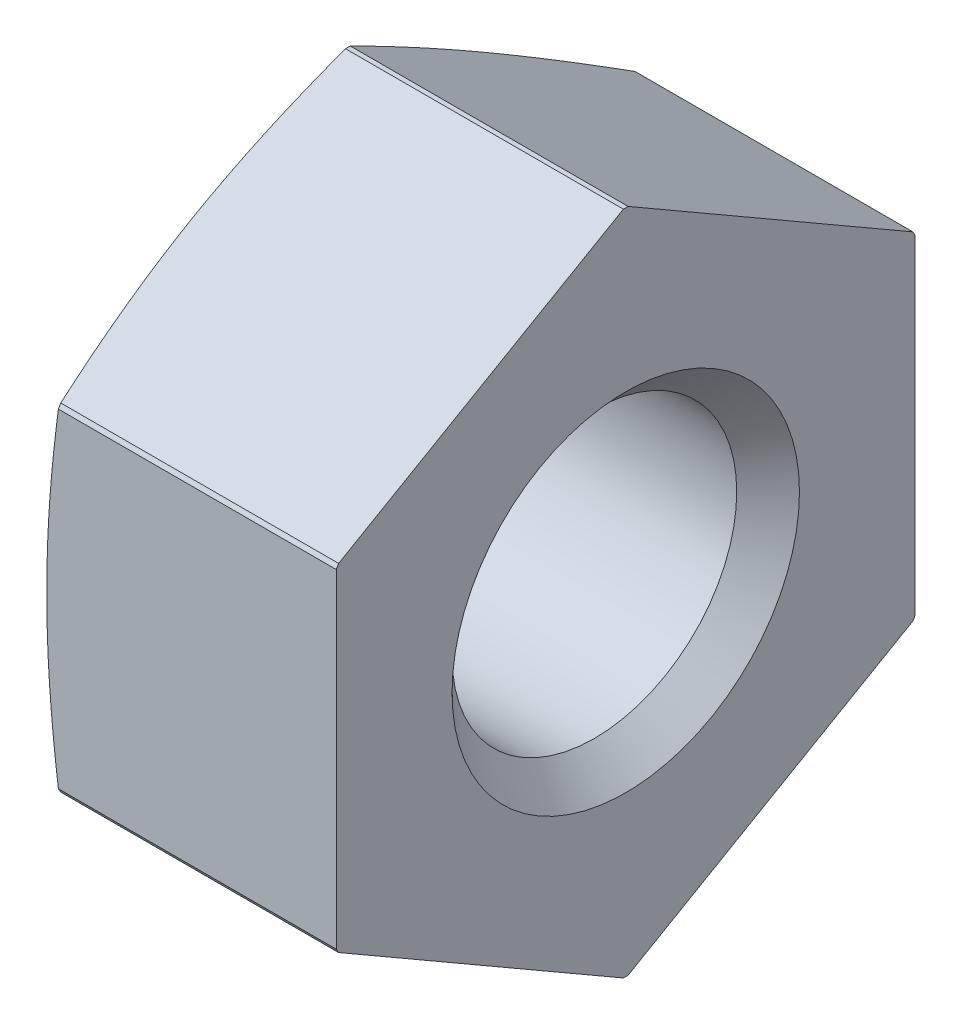
ISO-10303-21;
HEADER;
FILE_DESCRIPTION(('STEP AP214'),'2;1');
FILE_NAME('part.step','',(''),(''),'','','');
FILE_SCHEMA(('AUTOMOTIVE_DESIGN { 1 0 10303 214 1 1 1 1 }'));
ENDSEC;
DATA;
#1=APPLICATION_CONTEXT('core data for automotive mechanical design processes');
#2=APPLICATION_PROTOCOL_DEFINITION('international standard','automotive_design',2000,#1);
#3=PRODUCT_CONTEXT('',#1,'mechanical');
#4=PRODUCT('Part','Part','',(#3));
#5=PRODUCT_RELATED_PRODUCT_CATEGORY('part','',(#4));
#6=PRODUCT_DEFINITION_FORMATION('','',#4);
#7=PRODUCT_DEFINITION_CONTEXT('part definition',#1,'design');
#8=PRODUCT_DEFINITION('design','',#6,#7);
#9=PRODUCT_DEFINITION_SHAPE('','',#8);
#10=(LENGTH_UNIT() NAMED_UNIT(*) SI_UNIT(.MILLI.,.METRE.));
#11=(NAMED_UNIT(*) PLANE_ANGLE_UNIT() SI_UNIT($,.RADIAN.));
#12=(NAMED_UNIT(*) SI_UNIT($,.STERADIAN.) SOLID_ANGLE_UNIT());
#13=UNCERTAINTY_MEASURE_WITH_UNIT(LENGTH_MEASURE(1.E-05),#10,'distance_accuracy_value','');
#14=(GEOMETRIC_REPRESENTATION_CONTEXT(3) GLOBAL_UNCERTAINTY_ASSIGNED_CONTEXT((#13)) GLOBAL_UNIT_ASSIGNED_CONTEXT((#10,
#11,#12)) REPRESENTATION_CONTEXT('',''));
#15=CARTESIAN_POINT('',(0.,0.,0.));
#16=DIRECTION('',(0.,0.,1.));
#17=DIRECTION('',(1.,0.,0.));
#18=AXIS2_PLACEMENT_3D('',#15,#16,#17);
#19=CARTESIAN_POINT('',(4.4585,0.,0.));
#20=DIRECTION('',(1.,0.,0.));
#21=DIRECTION('',(0.,0.,-1.));
#22=AXIS2_PLACEMENT_3D('',#19,#20,#21);
#23=CONICAL_SURFACE('',#22,2.4585,0.785398163397448);
#24=CARTESIAN_POINT('',(4.4585,0.,0.));
#25=DIRECTION('',(1.,0.,0.));
#26=DIRECTION('',(0.,0.,-1.));
#27=AXIS2_PLACEMENT_3D('',#24,#25,#26);
#28=CIRCLE('',#27,2.4585);
#29=CARTESIAN_POINT('',(4.4585,0.,-2.4585));
#30=VERTEX_POINT('',#29);
#31=EDGE_CURVE('E10',#30,#30,#28,.T.);
#32=ORIENTED_EDGE('',*,*,#31,.F.);
#33=EDGE_LOOP('',(#32));
#34=FACE_BOUND('',#33,.T.);
#35=CARTESIAN_POINT('',(5.,0.,0.));
#36=DIRECTION('',(1.,0.,0.));
#37=DIRECTION('',(0.,0.,-1.));
#38=AXIS2_PLACEMENT_3D('',#35,#36,#37);
#39=CIRCLE('',#38,3.);
#40=CARTESIAN_POINT('',(5.,0.,-3.));
#41=VERTEX_POINT('',#40);
#42=EDGE_CURVE('E594',#41,#41,#39,.T.);
#43=ORIENTED_EDGE('',*,*,#42,.T.);
#44=EDGE_LOOP('',(#43));
#45=FACE_BOUND('',#44,.T.);
#46=ADVANCED_FACE('F16',(#34,#45),#23,.F.);
#47=CARTESIAN_POINT('',(5.,0.,0.));
#48=DIRECTION('',(1.,0.,0.));
#49=DIRECTION('',(0.,0.,-1.));
#50=AXIS2_PLACEMENT_3D('',#47,#48,#49);
#51=CYLINDRICAL_SURFACE('',#50,2.4585);
#52=CARTESIAN_POINT('',(0.5415,0.,0.));
#53=DIRECTION('',(1.,0.,0.));
#54=DIRECTION('',(0.,0.,-1.));
#55=AXIS2_PLACEMENT_3D('',#52,#53,#54);
#56=CIRCLE('',#55,2.4585);
#57=CARTESIAN_POINT('',(0.5415,0.,-2.4585));
#58=VERTEX_POINT('',#57);
#59=EDGE_CURVE('E25',#58,#58,#56,.T.);
#60=ORIENTED_EDGE('',*,*,#59,.F.);
#61=EDGE_LOOP('',(#60));
#62=FACE_BOUND('',#61,.T.);
#63=ORIENTED_EDGE('',*,*,#31,.T.);
#64=EDGE_LOOP('',(#63));
#65=FACE_BOUND('',#64,.T.);
#66=ADVANCED_FACE('F368',(#62,#65),#51,.F.);
#67=CARTESIAN_POINT('',(0.,0.,0.));
#68=DIRECTION('',(-1.,0.,0.));
#69=DIRECTION('',(0.,0.,1.));
#70=AXIS2_PLACEMENT_3D('',#67,#68,#69);
#71=CONICAL_SURFACE('',#70,3.,0.785398163397448);
#72=CARTESIAN_POINT('',(0.,0.,0.));
#73=DIRECTION('',(1.,0.,0.));
#74=DIRECTION('',(0.,0.,-1.));
#75=AXIS2_PLACEMENT_3D('',#72,#73,#74);
#76=CIRCLE('',#75,3.);
#77=CARTESIAN_POINT('',(0.,0.,-3.));
#78=VERTEX_POINT('',#77);
#79=EDGE_CURVE('E343',#78,#78,#76,.T.);
#80=ORIENTED_EDGE('',*,*,#79,.F.);
#81=EDGE_LOOP('',(#80));
#82=FACE_BOUND('',#81,.T.);
#83=ORIENTED_EDGE('',*,*,#59,.T.);
#84=EDGE_LOOP('',(#83));
#85=FACE_BOUND('',#84,.T.);
#86=ADVANCED_FACE('F364',(#82,#85),#71,.F.);
#87=CARTESIAN_POINT('',(5.,2.88675134594813,5.));
#88=DIRECTION('',(0.,0.,-1.));
#89=DIRECTION('',(0.,-1.,0.));
#90=AXIS2_PLACEMENT_3D('',#87,#88,#89);
#91=PLANE('',#90);
#92=CARTESIAN_POINT('',(0.,0.,5.));
#93=CARTESIAN_POINT('',(-1.56394899332542E-05,0.118134414952575,4.99996612564274));
#94=CARTESIAN_POINT('',(0.00109131026507877,0.236268848966435,4.9998869593378));
#95=CARTESIAN_POINT('',(0.00552505996837069,0.471921201523133,4.99975954160297));
#96=CARTESIAN_POINT('',(0.00884103488114741,0.589439323557016,4.99971114165587));
#97=CARTESIAN_POINT('',(0.0176899999024125,0.824986574850433,4.99976421079055));
#98=CARTESIAN_POINT('',(0.0232341131997657,0.943015284025696,4.99986643875971));
#99=CARTESIAN_POINT('',(0.0365059574589145,1.18066422342121,5.00007134557091));
#100=CARTESIAN_POINT('',(0.0442641587286164,1.30028273912887,5.00017400949008));
#101=CARTESIAN_POINT('',(0.0615437457322388,1.53627326470136,5.00020093679636));
#102=CARTESIAN_POINT('',(0.0710141915264018,1.65264902340276,5.00012975741928));
#103=CARTESIAN_POINT('',(0.0918634023536002,1.88625532449738,5.00002068923231));
#104=CARTESIAN_POINT('',(0.103258136289721,2.00348443881167,4.99998309708907));
#105=CARTESIAN_POINT('',(0.127938928012543,2.23946582454372,4.99994944584597));
#106=CARTESIAN_POINT('',(0.141250078510824,2.35821545684448,4.99995399863429));
#107=CARTESIAN_POINT('',(0.169755688613664,2.59783134083271,4.99997552754731));
#108=CARTESIAN_POINT('',(0.184981740434793,2.71869384207346,4.9999927435611));
#109=CARTESIAN_POINT('',(0.200961894323351,2.83945417290022,5.));
#110=B_SPLINE_CURVE_WITH_KNOTS('',3,(#92,#93,#94,#95,#96,#97,#98,#99,#100,#101,#102,#103,#104,
#105,#106,#107,#108,#109),.UNSPECIFIED.,.F.,.F.,(4,2,2,2,2,2,2,2,4),(0.,0.354397852180794,
0.707071675621917,1.06152841226116,1.42112012850098,1.77138693007306,2.1247178004938,
2.48318651892326,2.84862679658552),.UNSPECIFIED.);
#111=CARTESIAN_POINT('',(0.,0.,5.));
#112=VERTEX_POINT('',#111);
#113=CARTESIAN_POINT('',(0.200961894323063,2.83945417290028,5.));
#114=VERTEX_POINT('',#113);
#115=EDGE_CURVE('E566',#112,#114,#110,.T.);
#116=ORIENTED_EDGE('',*,*,#115,.F.);
#117=CARTESIAN_POINT('',(0.20096189432334,-2.83945417290014,5.));
#118=CARTESIAN_POINT('',(0.18504590631698,-2.71917823615069,4.99999299081326));
#119=CARTESIAN_POINT('',(0.169877253347112,-2.5988010601458,4.99997303141247));
#120=CARTESIAN_POINT('',(0.141470767602061,-2.36015052068105,4.99994209301392));
#121=CARTESIAN_POINT('',(0.128201594919902,-2.24188087981924,4.99993094980274));
#122=CARTESIAN_POINT('',(0.103589204328783,-2.00686176917269,4.99994952141708));
#123=CARTESIAN_POINT('',(0.0922210068570095,-1.89011493003101,4.99997865026816));
#124=CARTESIAN_POINT('',(0.0714091339877833,-1.65748427890769,5.00007065009244));
#125=CARTESIAN_POINT('',(0.0619494148829478,-1.54160190505922,5.00013322211231));
#126=CARTESIAN_POINT('',(0.0446050460094561,-1.30565241561207,5.00009827631857));
#127=CARTESIAN_POINT('',(0.0367868813982191,-1.18558038655077,4.99999509565634));
#128=CARTESIAN_POINT('',(0.0234124710118818,-0.947011312021322,4.99979847492332));
#129=CARTESIAN_POINT('',(0.0178258270894764,-0.828515983626977,4.99970491782477));
#130=CARTESIAN_POINT('',(0.00890863625723667,-0.592010550876972,4.99967242852331));
#131=CARTESIAN_POINT('',(0.00556737176793311,-0.474000852629486,4.99973275508777));
#132=CARTESIAN_POINT('',(0.00109932049827841,-0.237327566370387,4.99987927057252));
#133=CARTESIAN_POINT('',(-1.58961555067664E-05,-0.11866376009182,4.99996559194746));
#134=CARTESIAN_POINT('',(0.,0.,5.));
#135=B_SPLINE_CURVE_WITH_KNOTS('',3,(#117,#118,#119,#120,#121,#122,#123,#124,#125,#126,#127,
#128,#129,#130,#131,#132,#133,#134),.UNSPECIFIED.,.F.,.F.,(4,2,2,2,2,2,2,2,4),(0.,
0.363974382513806,0.720998223150018,1.07288154263148,1.4216706831219,1.78263150437755,
2.13849227028299,2.4926421528419,2.84862802420371),.UNSPECIFIED.);
#136=CARTESIAN_POINT('',(0.200961894323341,-2.83945417290014,5.));
#137=VERTEX_POINT('',#136);
#138=EDGE_CURVE('E265',#137,#112,#135,.T.);
#139=ORIENTED_EDGE('',*,*,#138,.F.);
#140=DIRECTION('',(-1.,0.,0.));
#141=VECTOR('',#140,1.);
#142=CARTESIAN_POINT('',(5.,-2.83945417290014,5.));
#143=LINE('',#142,#141);
#144=CARTESIAN_POINT('',(5.,-2.83945417290014,5.));
#145=VERTEX_POINT('',#144);
#146=EDGE_CURVE('E335',#145,#137,#143,.T.);
#147=ORIENTED_EDGE('',*,*,#146,.F.);
#148=DIRECTION('',(0.,-1.,0.));
#149=VECTOR('',#148,1.);
#150=CARTESIAN_POINT('',(5.,5.75,5.));
#151=LINE('',#150,#149);
#152=CARTESIAN_POINT('',(5.,2.83945417290014,5.));
#153=VERTEX_POINT('',#152);
#154=EDGE_CURVE('E663',#153,#145,#151,.T.);
#155=ORIENTED_EDGE('',*,*,#154,.F.);
#156=DIRECTION('',(1.,0.,0.));
#157=VECTOR('',#156,1.);
#158=CARTESIAN_POINT('',(5.,2.83945417290014,5.));
#159=LINE('',#158,#157);
#160=EDGE_CURVE('E376',#114,#153,#159,.T.);
#161=ORIENTED_EDGE('',*,*,#160,.F.);
#162=EDGE_LOOP('',(#116,#139,#147,#155,#161));
#163=FACE_BOUND('',#162,.T.);
#164=ADVANCED_FACE('F353',(#163),#91,.F.);
#165=CARTESIAN_POINT('',(5.,5.77350269189626,0.));
#166=DIRECTION('',(0.,-0.866025403784439,-0.5));
#167=DIRECTION('',(0.,0.5,-0.866025403784439));
#168=AXIS2_PLACEMENT_3D('',#165,#166,#167);
#169=PLANE('',#168);
#170=CARTESIAN_POINT('',(0.,4.33012701892219,2.5));
#171=CARTESIAN_POINT('',(-1.563018569586E-05,4.38917642290463,2.39765577007724));
#172=CARTESIAN_POINT('',(0.00109075431247008,4.44818334096372,2.29528697047928));
#173=CARTESIAN_POINT('',(0.00552294486206439,4.56590334503117,2.09111299855063));
#174=CARTESIAN_POINT('',(0.00883758019261582,4.62461641889863,1.98930757682533));
#175=CARTESIAN_POINT('',(0.0176834193882167,4.74241852351415,1.78534576519673));
#176=CARTESIAN_POINT('',(0.0232253884845095,4.80150798824149,1.68319009505596));
#177=CARTESIAN_POINT('',(0.0364926244617196,4.92047732635382,1.47752006406532));
#178=CARTESIAN_POINT('',(0.044248024387455,4.9803563992826,1.37400719866661));
#179=CARTESIAN_POINT('',(0.0615240367191803,5.0983522769477,1.16969076365131));
#180=CARTESIAN_POINT('',(0.0709939885987293,5.15647471740779,1.06888614274993));
#181=CARTESIAN_POINT('',(0.0918434029853629,5.27318414405083,0.866542975999504));
#182=CARTESIAN_POINT('',(0.103239043268147,5.33177068257933,0.765005842449694));
#183=CARTESIAN_POINT('',(0.127922948820436,5.44974811589956,0.560621011859134));
#184=CARTESIAN_POINT('',(0.14123651243629,5.50913821047582,0.457775925545056));
#185=CARTESIAN_POINT('',(0.169748267767096,5.62899220474612,0.250244547476865));
#186=CARTESIAN_POINT('',(0.184978243678139,5.68945437245477,0.145561612917954));
#187=CARTESIAN_POINT('',(0.20096189432334,5.74985410537226,0.0409605533867528));
#188=B_SPLINE_CURVE_WITH_KNOTS('',3,(#170,#171,#172,#173,#174,#175,#176,#177,#178,#179,#180,
#181,#182,#183,#184,#185,#186,#187),.UNSPECIFIED.,.F.,.F.,(4,2,2,2,2,2,2,2,4),(0.,
0.354466853698164,0.707154070311391,1.06156681085056,1.42105555935224,1.7712768465246,
2.12460167723162,2.48310660473679,2.84862771504354),.UNSPECIFIED.);
#189=CARTESIAN_POINT('',(0.,4.33012701892219,2.5));
#190=VERTEX_POINT('',#189);
#191=CARTESIAN_POINT('',(0.200961894323342,5.74985410537226,0.0409605533867494));
#192=VERTEX_POINT('',#191);
#193=EDGE_CURVE('E625',#190,#192,#188,.T.);
#194=ORIENTED_EDGE('',*,*,#193,.F.);
#195=CARTESIAN_POINT('',(0.20096189432334,2.91039993247213,4.95903944661325));
#196=CARTESIAN_POINT('',(0.184979654055989,2.97078200472686,4.8544404156225));
#197=CARTESIAN_POINT('',(0.169751168292614,3.03120452367695,4.74974680671267));
#198=CARTESIAN_POINT('',(0.141241336661504,3.15100006976638,4.54219766037841));
#199=CARTESIAN_POINT('',(0.127928306832241,3.21037105410911,4.43934528693758));
#200=CARTESIAN_POINT('',(0.103244483764465,3.32838668481115,4.2349821751477));
#201=CARTESIAN_POINT('',(0.0918484949992326,3.38702948689448,4.13347343215969));
#202=CARTESIAN_POINT('',(0.0709970785720899,3.50391393856041,3.93121604489246));
#203=CARTESIAN_POINT('',(0.0615255770091035,3.56215462039286,3.83046850199679));
#204=CARTESIAN_POINT('',(0.044248171479122,3.68009503854947,3.6261204358348));
#205=CARTESIAN_POINT('',(0.0364926022459771,3.73979287968768,3.52251454058605));
#206=CARTESIAN_POINT('',(0.0232251857450336,3.85841529765805,3.31665956711901));
#207=CARTESIAN_POINT('',(0.0176833152958326,3.91733894100994,3.21441190061866));
#208=CARTESIAN_POINT('',(0.00883749435947643,4.03507594880238,3.01041215781488));
#209=CARTESIAN_POINT('',(0.00552290473663361,4.09388847980289,2.90866006399583));
#210=CARTESIAN_POINT('',(0.00109068340707214,4.21185728961955,2.70461370382049));
#211=CARTESIAN_POINT('',(-1.56495312060279E-05,4.27101379090819,2.60231932075092));
#212=CARTESIAN_POINT('',(0.,4.33012701892219,2.5));
#213=B_SPLINE_CURVE_WITH_KNOTS('',3,(#195,#196,#197,#198,#199,#200,#201,#202,#203,#204,#205,
#206,#207,#208,#209,#210,#211,#212),.UNSPECIFIED.,.F.,.F.,(4,2,2,2,2,2,2,2,4),(0.,
0.365489063060598,0.723984138575084,1.07731966532983,1.4275703043205,1.7870290020465,
2.14143200698927,2.49412985361802,2.84862773526764),.UNSPECIFIED.);
#214=CARTESIAN_POINT('',(0.200961894323341,2.91039993247213,4.95903944661325));
#215=VERTEX_POINT('',#214);
#216=EDGE_CURVE('E539',#215,#190,#213,.T.);
#217=ORIENTED_EDGE('',*,*,#216,.F.);
#218=DIRECTION('',(-1.,0.,0.));
#219=VECTOR('',#218,1.);
#220=CARTESIAN_POINT('',(5.,2.91039993247213,4.95903944661325));
#221=LINE('',#220,#219);
#222=CARTESIAN_POINT('',(5.,2.91039993247213,4.95903944661325));
#223=VERTEX_POINT('',#222);
#224=EDGE_CURVE('E394',#223,#215,#221,.T.);
#225=ORIENTED_EDGE('',*,*,#224,.F.);
#226=DIRECTION('',(0.,-0.5,0.866025403784439));
#227=VECTOR('',#226,1.);
#228=CARTESIAN_POINT('',(5.,5.76762701892219,0.0101769641197387));
#229=LINE('',#228,#227);
#230=CARTESIAN_POINT('',(5.,5.74985410537226,0.0409605533867507));
#231=VERTEX_POINT('',#230);
#232=EDGE_CURVE('E665',#231,#223,#229,.T.);
#233=ORIENTED_EDGE('',*,*,#232,.F.);
#234=DIRECTION('',(1.,0.,0.));
#235=VECTOR('',#234,1.);
#236=CARTESIAN_POINT('',(5.,5.74985410537226,0.0409605533867497));
#237=LINE('',#236,#235);
#238=EDGE_CURVE('E591',#192,#231,#237,.T.);
#239=ORIENTED_EDGE('',*,*,#238,.F.);
#240=EDGE_LOOP('',(#194,#217,#225,#233,#239));
#241=FACE_BOUND('',#240,.T.);
#242=ADVANCED_FACE('F363',(#241),#169,.F.);
#243=CARTESIAN_POINT('',(5.,2.88675134594813,-5.));
#244=DIRECTION('',(0.,-0.866025403784439,0.5));
#245=DIRECTION('',(-1.,0.,0.));
#246=AXIS2_PLACEMENT_3D('',#243,#244,#245);
#247=PLANE('',#246);
#248=CARTESIAN_POINT('',(0.,4.33012701892219,-2.50000000000001));
#249=CARTESIAN_POINT('',(-1.56302611201995E-05,4.2710189420968,-2.6023105298157));
#250=CARTESIAN_POINT('',(0.00109075693730638,4.21186834381894,-2.70459655027759));
#251=CARTESIAN_POINT('',(0.00552295838240758,4.09390834855175,-2.90863230800762));
#252=CARTESIAN_POINT('',(0.00883760182310537,4.03509872950938,-3.01038215946058));
#253=CARTESIAN_POINT('',(0.01768346271903,3.91736352308043,-3.21438293512135));
#254=CARTESIAN_POINT('',(0.0232254454264165,3.85843877601952,-3.31663387528545));
#255=CARTESIAN_POINT('',(0.0364927139429888,3.73980782394998,-3.52249961851318));
#256=CARTESIAN_POINT('',(0.0442481329081808,3.68010251382102,-3.6261129806315));
#257=CARTESIAN_POINT('',(0.0615241657028296,3.56215722832938,-3.8304586283663));
#258=CARTESIAN_POINT('',(0.0709941140969034,3.5039191605619,-3.93119632082737));
#259=CARTESIAN_POINT('',(0.0918435165871481,3.387039699912,-4.13344097756368));
#260=CARTESIAN_POINT('',(0.103239148444823,3.32839930629116,-4.23494684801057));
#261=CARTESIAN_POINT('',(0.1279230322732,3.21038571656078,-4.43931046186222));
#262=CARTESIAN_POINT('',(0.141236582519083,3.15101438129181,-4.54216620690001));
#263=CARTESIAN_POINT('',(0.169748306300074,3.03121408450263,-4.74972823834279));
#264=CARTESIAN_POINT('',(0.184978263920985,2.97078716439432,-4.8544313462145));
#265=CARTESIAN_POINT('',(0.20096189432334,2.91039993247213,-4.95903944661325));
#266=B_SPLINE_CURVE_WITH_KNOTS('',3,(#248,#249,#250,#251,#252,#253,#254,#255,#256,#257,#258,
#259,#260,#261,#262,#263,#264,#265),.UNSPECIFIED.,.F.,.F.,(4,2,2,2,2,2,2,2,4),(0.,
0.354467307499474,0.707154966506949,1.06156815068427,1.42105735579972,1.7712781994309,
2.12460258853365,2.48310706761453,2.84862771512714),.UNSPECIFIED.);
#267=CARTESIAN_POINT('',(0.,4.33012701892219,-2.5));
#268=VERTEX_POINT('',#267);
#269=CARTESIAN_POINT('',(0.200961894323342,2.91039993247213,-4.95903944661325));
#270=VERTEX_POINT('',#269);
#271=EDGE_CURVE('E500',#268,#270,#266,.T.);
#272=ORIENTED_EDGE('',*,*,#271,.F.);
#273=CARTESIAN_POINT('',(0.20096189432334,5.74985410537226,-0.040960553386742));
#274=CARTESIAN_POINT('',(0.184979633861451,5.68945964714212,-0.145552609498016));
#275=CARTESIAN_POINT('',(0.169751129859231,5.62900350540713,-0.250226982764276));
#276=CARTESIAN_POINT('',(0.141241266744135,5.50915829492585,-0.457747803686648));
#277=CARTESIAN_POINT('',(0.127928223563074,5.44977094487172,-0.560590900223424));
#278=CARTESIAN_POINT('',(0.103244378773568,5.33179496688786,-0.764977247371082));
#279=CARTESIAN_POINT('',(0.0918483815709577,5.27320714485292,-0.866517903104201));
#280=CARTESIAN_POINT('',(0.0709969531772034,5.15648918845634,-1.06887175783639));
#281=CARTESIAN_POINT('',(0.0615254480745191,5.09835952404858,-1.16968356804914));
#282=CARTESIAN_POINT('',(0.0442480629596628,4.98035911813949,-1.3739969969377));
#283=CARTESIAN_POINT('',(0.0364925127609605,4.92048277731189,-1.47749966021377));
#284=CARTESIAN_POINT('',(0.0232251287944222,4.80151849921404,-1.68315691513549));
#285=CARTESIAN_POINT('',(0.017683271960079,4.74243131778665,-1.78530999251395));
#286=CARTESIAN_POINT('',(0.00883747272539096,4.6246310083933,-1.98927284777551));
#287=CARTESIAN_POINT('',(0.00552289121449551,4.56591744854052,-2.09108191263908));
#288=CARTESIAN_POINT('',(0.00109068077976786,4.44819266959259,-2.29526881986135));
#289=CARTESIAN_POINT('',(-1.56494564395332E-05,4.38918146065831,-2.39764691324222));
#290=CARTESIAN_POINT('',(0.,4.33012701892219,-2.50000000000001));
#291=B_SPLINE_CURVE_WITH_KNOTS('',3,(#273,#274,#275,#276,#277,#278,#279,#280,#281,#282,#283,
#284,#285,#286,#287,#288,#289,#290),.UNSPECIFIED.,.F.,.F.,(4,2,2,2,2,2,2,2,4),(0.,
0.365489524757108,0.723985048370732,1.07732101711773,1.4275721006823,1.78703034073609,
2.14143290168758,2.49413030627549,2.84862773518438),.UNSPECIFIED.);
#292=CARTESIAN_POINT('',(0.200961894323341,5.74985410537226,-0.0409605533867497));
#293=VERTEX_POINT('',#292);
#294=EDGE_CURVE('E613',#293,#268,#291,.T.);
#295=ORIENTED_EDGE('',*,*,#294,.F.);
#296=DIRECTION('',(-1.,0.,0.));
#297=VECTOR('',#296,1.);
#298=CARTESIAN_POINT('',(5.,5.74985410537226,-0.0409605533867497));
#299=LINE('',#298,#297);
#300=CARTESIAN_POINT('',(5.,5.74985410537226,-0.0409605533867497));
#301=VERTEX_POINT('',#300);
#302=EDGE_CURVE('E595',#301,#293,#299,.T.);
#303=ORIENTED_EDGE('',*,*,#302,.F.);
#304=DIRECTION('',(0.,0.5,0.866025403784439));
#305=VECTOR('',#304,1.);
#306=CARTESIAN_POINT('',(5.,5.76762701892219,-0.0101769641197387));
#307=LINE('',#306,#305);
#308=CARTESIAN_POINT('',(5.,2.91039993247213,-4.95903944661325));
#309=VERTEX_POINT('',#308);
#310=EDGE_CURVE('E605',#309,#301,#307,.T.);
#311=ORIENTED_EDGE('',*,*,#310,.F.);
#312=DIRECTION('',(1.,0.,0.));
#313=VECTOR('',#312,1.);
#314=CARTESIAN_POINT('',(5.,2.91039993247213,-4.95903944661325));
#315=LINE('',#314,#313);
#316=EDGE_CURVE('E522',#270,#309,#315,.T.);
#317=ORIENTED_EDGE('',*,*,#316,.F.);
#318=EDGE_LOOP('',(#272,#295,#303,#311,#317));
#319=FACE_BOUND('',#318,.T.);
#320=ADVANCED_FACE('F474',(#319),#247,.F.);
#321=CARTESIAN_POINT('',(5.,-2.88675134594813,-5.));
#322=DIRECTION('',(0.,0.,1.));
#323=DIRECTION('',(1.,0.,0.));
#324=AXIS2_PLACEMENT_3D('',#321,#322,#323);
#325=PLANE('',#324);
#326=CARTESIAN_POINT('',(0.,0.,-5.));
#327=CARTESIAN_POINT('',(-1.56394899332771E-05,-0.118134414952564,-4.99996612564274));
#328=CARTESIAN_POINT('',(0.00109131026507875,-0.236268848966425,-4.9998869593378));
#329=CARTESIAN_POINT('',(0.0055250599683707,-0.471921201523122,-4.99975954160297));
#330=CARTESIAN_POINT('',(0.00884103488114742,-0.589439323557004,-4.99971114165587));
#331=CARTESIAN_POINT('',(0.0176899999024125,-0.82498657485042,-4.99976421079055));
#332=CARTESIAN_POINT('',(0.0232341131997657,-0.943015284025683,-4.99986643875972));
#333=CARTESIAN_POINT('',(0.0365059574589145,-1.1806642234212,-5.00007134557091));
#334=CARTESIAN_POINT('',(0.0442641587286163,-1.30028273912886,-5.00017400949008));
#335=CARTESIAN_POINT('',(0.0615437457322388,-1.53627326470135,-5.00020093679636));
#336=CARTESIAN_POINT('',(0.0710141915264019,-1.65264902340275,-5.00012975741928));
#337=CARTESIAN_POINT('',(0.0918634023536004,-1.88625532449737,-5.00002068923232));
#338=CARTESIAN_POINT('',(0.103258136289721,-2.00348443881165,-4.99998309708908));
#339=CARTESIAN_POINT('',(0.127938928012543,-2.23946582454371,-4.99994944584597));
#340=CARTESIAN_POINT('',(0.141250078510824,-2.35821545684447,-4.9999539986343));
#341=CARTESIAN_POINT('',(0.169755688613664,-2.5978313408327,-4.99997552754731));
#342=CARTESIAN_POINT('',(0.184981740434793,-2.71869384207345,-4.9999927435611));
#343=CARTESIAN_POINT('',(0.200961894323351,-2.83945417290021,-5.));
#344=B_SPLINE_CURVE_WITH_KNOTS('',3,(#326,#327,#328,#329,#330,#331,#332,#333,#334,#335,#336,
#337,#338,#339,#340,#341,#342,#343),.UNSPECIFIED.,.F.,.F.,(4,2,2,2,2,2,2,2,4),(0.,
0.354397852180794,0.707071675621915,1.06152841226116,1.42112012850098,1.77138693007305,
2.1247178004938,2.48318651892327,2.84862679658553),.UNSPECIFIED.);
#345=CARTESIAN_POINT('',(0.,0.,-5.));
#346=VERTEX_POINT('',#345);
#347=CARTESIAN_POINT('',(0.200961894323063,-2.83945417290028,-5.));
#348=VERTEX_POINT('',#347);
#349=EDGE_CURVE('E412',#346,#348,#344,.T.);
#350=ORIENTED_EDGE('',*,*,#349,.F.);
#351=CARTESIAN_POINT('',(0.20096189432334,2.83945417290014,-5.));
#352=CARTESIAN_POINT('',(0.185045906317004,2.71917823615087,-4.99999299081326));
#353=CARTESIAN_POINT('',(0.169877253347162,2.59880106014617,-4.99997303141249));
#354=CARTESIAN_POINT('',(0.141470767602145,2.36015052068166,-4.99994209301397));
#355=CARTESIAN_POINT('',(0.128201594919995,2.2418808798199,-4.99993094980283));
#356=CARTESIAN_POINT('',(0.103589204328877,2.00686176917334,-4.9999495214172));
#357=CARTESIAN_POINT('',(0.0922210068570972,1.89011493003159,-4.99997865026828));
#358=CARTESIAN_POINT('',(0.0714091339878356,1.65748427890804,-5.00007065009254));
#359=CARTESIAN_POINT('',(0.0619494148829727,1.5416019050594,-5.00013322211236));
#360=CARTESIAN_POINT('',(0.0446050460094568,1.30565241561226,-5.00009827631852));
#361=CARTESIAN_POINT('',(0.0367868813982171,1.18558038655113,-4.99999509565624));
#362=CARTESIAN_POINT('',(0.0234124710118771,0.947011312021925,-4.99979847492319));
#363=CARTESIAN_POINT('',(0.0178258270894737,0.828515983627639,-4.99970491782465));
#364=CARTESIAN_POINT('',(0.00890863625723478,0.592010550877632,-4.99967242852323));
#365=CARTESIAN_POINT('',(0.00556737176793217,0.474000852630085,-4.99973275508771));
#366=CARTESIAN_POINT('',(0.00109932049827706,0.237327566370743,-4.9998792705725));
#367=CARTESIAN_POINT('',(-1.58961555071596E-05,0.118663760091993,-4.99996559194745));
#368=CARTESIAN_POINT('',(0.,0.,-5.));
#369=B_SPLINE_CURVE_WITH_KNOTS('',3,(#351,#352,#353,#354,#355,#356,#357,#358,#359,#360,#361,
#362,#363,#364,#365,#366,#367,#368),.UNSPECIFIED.,.F.,.F.,(4,2,2,2,2,2,2,2,4),(0.,
0.363974382513246,0.720998223149289,1.07288154263095,1.42167068312189,1.782631504377,
2.13849227028227,2.49264215284136,2.84862802420372),.UNSPECIFIED.);
#370=CARTESIAN_POINT('',(0.200961894323341,2.83945417290014,-5.));
#371=VERTEX_POINT('',#370);
#372=EDGE_CURVE('E413',#371,#346,#369,.T.);
#373=ORIENTED_EDGE('',*,*,#372,.F.);
#374=DIRECTION('',(-1.,0.,0.));
#375=VECTOR('',#374,1.);
#376=CARTESIAN_POINT('',(5.,2.83945417290014,-5.));
#377=LINE('',#376,#375);
#378=CARTESIAN_POINT('',(5.,2.83945417290014,-5.));
#379=VERTEX_POINT('',#378);
#380=EDGE_CURVE('E486',#379,#371,#377,.T.);
#381=ORIENTED_EDGE('',*,*,#380,.F.);
#382=DIRECTION('',(0.,1.,0.));
#383=VECTOR('',#382,1.);
#384=CARTESIAN_POINT('',(5.,5.75,-5.));
#385=LINE('',#384,#383);
#386=CARTESIAN_POINT('',(5.,-2.83945417290014,-5.));
#387=VERTEX_POINT('',#386);
#388=EDGE_CURVE('E657',#387,#379,#385,.T.);
#389=ORIENTED_EDGE('',*,*,#388,.F.);
#390=DIRECTION('',(1.,0.,0.));
#391=VECTOR('',#390,1.);
#392=CARTESIAN_POINT('',(5.,-2.83945417290014,-5.));
#393=LINE('',#392,#391);
#394=EDGE_CURVE('E463',#348,#387,#393,.T.);
#395=ORIENTED_EDGE('',*,*,#394,.F.);
#396=EDGE_LOOP('',(#350,#373,#381,#389,#395));
#397=FACE_BOUND('',#396,.T.);
#398=ADVANCED_FACE('F465',(#397),#325,.F.);
#399=CARTESIAN_POINT('',(5.,-5.77350269189626,0.));
#400=DIRECTION('',(0.,0.866025403784439,0.5));
#401=DIRECTION('',(1.,0.,0.));
#402=AXIS2_PLACEMENT_3D('',#399,#400,#401);
#403=PLANE('',#402);
#404=CARTESIAN_POINT('',(0.,-4.33012701892219,-2.5));
#405=CARTESIAN_POINT('',(-1.56301856994798E-05,-4.38917642290555,-2.39765577007561));
#406=CARTESIAN_POINT('',(0.00109075431245649,-4.44818334096544,-2.29528697047594));
#407=CARTESIAN_POINT('',(0.00552294486205452,-4.56590334503376,-2.09111299854491));
#408=CARTESIAN_POINT('',(0.00883758019259606,-4.62461641890131,-1.98930757681894));
#409=CARTESIAN_POINT('',(0.0176834193881895,-4.7424185235165,-1.78534576519014));
#410=CARTESIAN_POINT('',(0.0232253884844616,-4.80150798824342,-1.68319009504985));
#411=CARTESIAN_POINT('',(0.0364926244616991,-4.92047732635482,-1.47752006406157));
#412=CARTESIAN_POINT('',(0.0442480243874624,-4.9803563992831,-1.37400719866474));
#413=CARTESIAN_POINT('',(0.0615240367194398,-5.09835227694903,-1.16969076365));
#414=CARTESIAN_POINT('',(0.0709939885992739,-5.15647471741045,-1.06888614274729));
#415=CARTESIAN_POINT('',(0.0918434029862775,-5.27318414405506,-0.866542975994898));
#416=CARTESIAN_POINT('',(0.103239043269127,-5.33177068258379,-0.765005842444441));
#417=CARTESIAN_POINT('',(0.127922948821405,-5.44974811590376,-0.560621011853598));
#418=CARTESIAN_POINT('',(0.141236512437163,-5.50913821047952,-0.457775925539882));
#419=CARTESIAN_POINT('',(0.169748267767622,-5.62899220474819,-0.250244547473622));
#420=CARTESIAN_POINT('',(0.184978243678394,-5.68945437245574,-0.145561612916282));
#421=CARTESIAN_POINT('',(0.20096189432334,-5.74985410537226,-0.040960553386733));
#422=B_SPLINE_CURVE_WITH_KNOTS('',3,(#404,#405,#406,#407,#408,#409,#410,#411,#412,#413,#414,
#415,#416,#417,#418,#419,#420,#421),.UNSPECIFIED.,.F.,.F.,(4,2,2,2,2,2,2,2,4),(0.,
0.354466853703799,0.707154070318901,1.0615668108562,1.42105555935225,1.7712768465301,
2.12460167723916,2.48310660474262,2.84862771504356),.UNSPECIFIED.);
#423=CARTESIAN_POINT('',(0.,-4.33012701892219,-2.5));
#424=VERTEX_POINT('',#423);
#425=CARTESIAN_POINT('',(0.200961894323342,-5.74985410537226,-0.0409605533867494));
#426=VERTEX_POINT('',#425);
#427=EDGE_CURVE('E176',#424,#426,#422,.T.);
#428=ORIENTED_EDGE('',*,*,#427,.F.);
#429=CARTESIAN_POINT('',(0.20096189432334,-2.91039993247215,-4.95903944661324));
#430=CARTESIAN_POINT('',(0.184979654055648,-2.97078200472814,-4.85444041562026));
#431=CARTESIAN_POINT('',(0.169751168291913,-3.03120452367931,-4.74974680670811));
#432=CARTESIAN_POINT('',(0.141241336660338,-3.15100006976991,-4.54219766037069));
#433=CARTESIAN_POINT('',(0.127928306830948,-3.21037105411272,-4.43934528692903));
#434=CARTESIAN_POINT('',(0.103244483763157,-3.32838668481425,-4.23498217513903));
#435=CARTESIAN_POINT('',(0.0918484949980116,-3.387029486897,-4.13347343215172));
#436=CARTESIAN_POINT('',(0.0709970785713629,-3.5039139385617,-3.93121604488762));
#437=CARTESIAN_POINT('',(0.0615255770087576,-3.56215462039351,-3.83046850199436));
#438=CARTESIAN_POINT('',(0.0442481714791128,-3.68009503855132,-3.62612043583296));
#439=CARTESIAN_POINT('',(0.0364926022460046,-3.73979287969135,-3.52251454058238));
#440=CARTESIAN_POINT('',(0.0232251857450973,-3.85841529766381,-3.3166595671127));
#441=CARTESIAN_POINT('',(0.0176833152958687,-3.91733894101597,-3.21441190061155));
#442=CARTESIAN_POINT('',(0.00883749435950277,-4.03507594880797,-3.01041215780753));
#443=CARTESIAN_POINT('',(0.00552290473664676,-4.09388847980776,-2.90866006398902));
#444=CARTESIAN_POINT('',(0.00109068340709015,-4.21185728962226,-2.70461370381629));
#445=CARTESIAN_POINT('',(-1.56495312013164E-05,-4.27101379090945,-2.60231932074877));
#446=CARTESIAN_POINT('',(0.,-4.33012701892219,-2.5));
#447=B_SPLINE_CURVE_WITH_KNOTS('',3,(#429,#430,#431,#432,#433,#434,#435,#436,#437,#438,#439,
#440,#441,#442,#443,#444,#445,#446),.UNSPECIFIED.,.F.,.F.,(4,2,2,2,2,2,2,2,4),(0.,
0.365489063068343,0.723984138585132,1.07731966533715,1.42757030432051,1.78702900205399,
2.14143200699924,2.49412985362549,2.84862773526761),.UNSPECIFIED.);
#448=CARTESIAN_POINT('',(0.200961894323341,-2.91039993247213,-4.95903944661325));
#449=VERTEX_POINT('',#448);
#450=EDGE_CURVE('E259',#449,#424,#447,.T.);
#451=ORIENTED_EDGE('',*,*,#450,.F.);
#452=DIRECTION('',(-1.,0.,0.));
#453=VECTOR('',#452,1.);
#454=CARTESIAN_POINT('',(5.,-2.91039993247213,-4.95903944661325));
#455=LINE('',#454,#453);
#456=CARTESIAN_POINT('',(5.,-2.91039993247212,-4.95903944661325));
#457=VERTEX_POINT('',#456);
#458=EDGE_CURVE('E186',#457,#449,#455,.T.);
#459=ORIENTED_EDGE('',*,*,#458,.F.);
#460=DIRECTION('',(0.,0.5,-0.866025403784439));
#461=VECTOR('',#460,1.);
#462=CARTESIAN_POINT('',(5.,-2.89262701892219,-4.98982303588026));
#463=LINE('',#462,#461);
#464=CARTESIAN_POINT('',(5.,-5.74985410537226,-0.0409605533867478));
#465=VERTEX_POINT('',#464);
#466=EDGE_CURVE('E180',#465,#457,#463,.T.);
#467=ORIENTED_EDGE('',*,*,#466,.F.);
#468=DIRECTION('',(1.,0.,0.));
#469=VECTOR('',#468,1.);
#470=CARTESIAN_POINT('',(5.,-5.74985410537226,-0.0409605533867497));
#471=LINE('',#470,#469);
#472=EDGE_CURVE('E171',#426,#465,#471,.T.);
#473=ORIENTED_EDGE('',*,*,#472,.F.);
#474=EDGE_LOOP('',(#428,#451,#459,#467,#473));
#475=FACE_BOUND('',#474,.T.);
#476=ADVANCED_FACE('F173',(#475),#403,.F.);
#477=CARTESIAN_POINT('',(5.,-2.88675134594813,5.));
#478=DIRECTION('',(0.,0.866025403784439,-0.5));
#479=DIRECTION('',(-1.,0.,0.));
#480=AXIS2_PLACEMENT_3D('',#477,#478,#479);
#481=PLANE('',#480);
#482=CARTESIAN_POINT('',(0.,-4.33012701892219,2.5));
#483=CARTESIAN_POINT('',(-1.56302611214318E-05,-4.27101894209648,2.60231052981624));
#484=CARTESIAN_POINT('',(0.00109075693730184,-4.21186834381827,2.70459655027865));
#485=CARTESIAN_POINT('',(0.0055229583824043,-4.09390834855053,2.90863230800933));
#486=CARTESIAN_POINT('',(0.00883760182309881,-4.03509872950798,3.01038215946243));
#487=CARTESIAN_POINT('',(0.0176834627190209,-3.91736352307892,3.21438293512313));
#488=CARTESIAN_POINT('',(0.0232254454264006,-3.85843877601808,3.31663387528703));
#489=CARTESIAN_POINT('',(0.036492713942982,-3.73980782394906,3.5224996185141));
#490=CARTESIAN_POINT('',(0.0442481329081832,-3.68010251382056,3.62611298063197));
#491=CARTESIAN_POINT('',(0.0615241657029161,-3.56215722832922,3.83045862836691));
#492=CARTESIAN_POINT('',(0.0709941140970849,-3.50391916056157,3.93119632082858));
#493=CARTESIAN_POINT('',(0.0918435165874531,-3.38703969991137,4.13344097756568));
#494=CARTESIAN_POINT('',(0.10323914844515,-3.32839930629038,4.23494684801274));
#495=CARTESIAN_POINT('',(0.127923032273523,-3.21038571655987,4.43931046186436));
#496=CARTESIAN_POINT('',(0.141236582519374,-3.15101438129092,4.54216620690194));
#497=CARTESIAN_POINT('',(0.16974830630025,-3.03121408450204,4.74972823834394));
#498=CARTESIAN_POINT('',(0.18497826392107,-2.970787164394,4.85443134621506));
#499=CARTESIAN_POINT('',(0.20096189432334,-2.91039993247212,4.95903944661325));
#500=B_SPLINE_CURVE_WITH_KNOTS('',3,(#482,#483,#484,#485,#486,#487,#488,#489,#490,#491,#492,
#493,#494,#495,#496,#497,#498,#499),.UNSPECIFIED.,.F.,.F.,(4,2,2,2,2,2,2,2,4),(0.,
0.354467307501353,0.707154966509454,1.06156815068615,1.42105735579973,1.77127819943274,
2.12460258853617,2.48310706761647,2.84862771512715),.UNSPECIFIED.);
#501=CARTESIAN_POINT('',(0.,-4.33012701892219,2.5));
#502=VERTEX_POINT('',#501);
#503=CARTESIAN_POINT('',(0.200961894323342,-2.91039993247213,4.95903944661325));
#504=VERTEX_POINT('',#503);
#505=EDGE_CURVE('E264',#502,#504,#500,.T.);
#506=ORIENTED_EDGE('',*,*,#505,.F.);
#507=CARTESIAN_POINT('',(0.20096189432334,-5.74985410537226,0.04096055338673));
#508=CARTESIAN_POINT('',(0.184979633861621,-5.68945964714276,0.145552609496902));
#509=CARTESIAN_POINT('',(0.169751129859582,-5.62900350540851,0.250226982762115));
#510=CARTESIAN_POINT('',(0.141241266744718,-5.50915829492831,0.4577478036832));
#511=CARTESIAN_POINT('',(0.12792822356372,-5.44977094487452,0.560590900219737));
#512=CARTESIAN_POINT('',(0.103244378774222,-5.33179496689083,0.764977247367586));
#513=CARTESIAN_POINT('',(0.0918483815715681,-5.27320714485574,0.866517903101137));
#514=CARTESIAN_POINT('',(0.0709969531775668,-5.15648918845811,1.06887175783464));
#515=CARTESIAN_POINT('',(0.0615254480746922,-5.09835952404946,1.16968356804827));
#516=CARTESIAN_POINT('',(0.0442480629596677,-4.98035911813982,1.37399699693646));
#517=CARTESIAN_POINT('',(0.0364925127609468,-4.92048277731255,1.47749966021128));
#518=CARTESIAN_POINT('',(0.0232251287943903,-4.80151849921533,1.68315691513143));
#519=CARTESIAN_POINT('',(0.017683271960061,-4.74243131778821,1.78530999250958));
#520=CARTESIAN_POINT('',(0.00883747272537781,-4.62463100839508,1.98927284777126));
#521=CARTESIAN_POINT('',(0.00552289121448895,-4.56591744854224,2.09108191263527));
#522=CARTESIAN_POINT('',(0.00109068077975883,-4.44819266959373,2.29526881985913));
#523=CARTESIAN_POINT('',(-1.56494564419166E-05,-4.38918146065893,2.39764691324113));
#524=CARTESIAN_POINT('',(0.,-4.33012701892219,2.5));
#525=B_SPLINE_CURVE_WITH_KNOTS('',3,(#507,#508,#509,#510,#511,#512,#513,#514,#515,#516,#517,
#518,#519,#520,#521,#522,#523,#524),.UNSPECIFIED.,.F.,.F.,(4,2,2,2,2,2,2,2,4),(0.,
0.365489524753242,0.723985048365723,1.0773210171141,1.42757210068232,1.78703034073237,
2.14143290168261,2.49413030627176,2.84862773518439),.UNSPECIFIED.);
#526=CARTESIAN_POINT('',(0.200961894323341,-5.74985410537226,0.0409605533867497));
#527=VERTEX_POINT('',#526);
#528=EDGE_CURVE('E196',#527,#502,#525,.T.);
#529=ORIENTED_EDGE('',*,*,#528,.F.);
#530=DIRECTION('',(-1.,0.,0.));
#531=VECTOR('',#530,1.);
#532=CARTESIAN_POINT('',(5.,-5.74985410537226,0.0409605533867497));
#533=LINE('',#532,#531);
#534=CARTESIAN_POINT('',(5.,-5.74985410537226,0.0409605533867475));
#535=VERTEX_POINT('',#534);
#536=EDGE_CURVE('E192',#535,#527,#533,.T.);
#537=ORIENTED_EDGE('',*,*,#536,.F.);
#538=DIRECTION('',(0.,-0.5,-0.866025403784439));
#539=VECTOR('',#538,1.);
#540=CARTESIAN_POINT('',(5.,-2.89262701892219,4.98982303588026));
#541=LINE('',#540,#539);
#542=CARTESIAN_POINT('',(5.,-2.91039993247212,4.95903944661325));
#543=VERTEX_POINT('',#542);
#544=EDGE_CURVE('E660',#543,#535,#541,.T.);
#545=ORIENTED_EDGE('',*,*,#544,.F.);
#546=DIRECTION('',(1.,0.,0.));
#547=VECTOR('',#546,1.);
#548=CARTESIAN_POINT('',(5.,-2.91039993247213,4.95903944661325));
#549=LINE('',#548,#547);
#550=EDGE_CURVE('E327',#504,#543,#549,.T.);
#551=ORIENTED_EDGE('',*,*,#550,.F.);
#552=EDGE_LOOP('',(#506,#529,#537,#545,#551));
#553=FACE_BOUND('',#552,.T.);
#554=ADVANCED_FACE('F223',(#553),#481,.F.);
#555=CARTESIAN_POINT('',(5.,5.75,0.));
#556=DIRECTION('',(-1.,0.,0.));
#557=DIRECTION('',(0.,0.,1.));
#558=AXIS2_PLACEMENT_3D('',#555,#556,#557);
#559=PLANE('',#558);
#560=ORIENTED_EDGE('',*,*,#310,.T.);
#561=CARTESIAN_POINT('',(5.,0.,0.));
#562=DIRECTION('',(1.,0.,0.));
#563=DIRECTION('',(0.,0.,-1.));
#564=AXIS2_PLACEMENT_3D('',#561,#562,#563);
#565=CIRCLE('',#564,5.75);
#566=EDGE_CURVE('E607',#301,#231,#565,.T.);
#567=ORIENTED_EDGE('',*,*,#566,.T.);
#568=ORIENTED_EDGE('',*,*,#232,.T.);
#569=CARTESIAN_POINT('',(5.,0.,0.));
#570=DIRECTION('',(1.,0.,0.));
#571=DIRECTION('',(0.,0.,-1.));
#572=AXIS2_PLACEMENT_3D('',#569,#570,#571);
#573=CIRCLE('',#572,5.75);
#574=EDGE_CURVE('E384',#223,#153,#573,.T.);
#575=ORIENTED_EDGE('',*,*,#574,.T.);
#576=ORIENTED_EDGE('',*,*,#154,.T.);
#577=CARTESIAN_POINT('',(5.,0.,0.));
#578=DIRECTION('',(1.,0.,0.));
#579=DIRECTION('',(0.,0.,-1.));
#580=AXIS2_PLACEMENT_3D('',#577,#578,#579);
#581=CIRCLE('',#580,5.75);
#582=EDGE_CURVE('E252',#145,#543,#581,.T.);
#583=ORIENTED_EDGE('',*,*,#582,.T.);
#584=ORIENTED_EDGE('',*,*,#544,.T.);
#585=CARTESIAN_POINT('',(5.,0.,0.));
#586=DIRECTION('',(1.,0.,0.));
#587=DIRECTION('',(0.,0.,-1.));
#588=AXIS2_PLACEMENT_3D('',#585,#586,#587);
#589=CIRCLE('',#588,5.75);
#590=EDGE_CURVE('E185',#535,#465,#589,.T.);
#591=ORIENTED_EDGE('',*,*,#590,.T.);
#592=ORIENTED_EDGE('',*,*,#466,.T.);
#593=CARTESIAN_POINT('',(5.,0.,0.));
#594=DIRECTION('',(1.,0.,0.));
#595=DIRECTION('',(0.,0.,-1.));
#596=AXIS2_PLACEMENT_3D('',#593,#594,#595);
#597=CIRCLE('',#596,5.75);
#598=EDGE_CURVE('E669',#457,#387,#597,.T.);
#599=ORIENTED_EDGE('',*,*,#598,.T.);
#600=ORIENTED_EDGE('',*,*,#388,.T.);
#601=CARTESIAN_POINT('',(5.,0.,0.));
#602=DIRECTION('',(1.,0.,0.));
#603=DIRECTION('',(0.,0.,-1.));
#604=AXIS2_PLACEMENT_3D('',#601,#602,#603);
#605=CIRCLE('',#604,5.75);
#606=EDGE_CURVE('E494',#379,#309,#605,.T.);
#607=ORIENTED_EDGE('',*,*,#606,.T.);
#608=EDGE_LOOP('',(#560,#567,#568,#575,#576,#583,#584,#591,#592,#599,#600,#607));
#609=FACE_BOUND('',#608,.T.);
#610=ORIENTED_EDGE('',*,*,#42,.F.);
#611=EDGE_LOOP('',(#610));
#612=FACE_BOUND('',#611,.T.);
#613=ADVANCED_FACE('F703',(#609,#612),#559,.F.);
#614=CARTESIAN_POINT('',(5.,0.,0.));
#615=DIRECTION('',(1.,0.,0.));
#616=DIRECTION('',(0.,0.,-1.));
#617=AXIS2_PLACEMENT_3D('',#614,#615,#616);
#618=CYLINDRICAL_SURFACE('',#617,5.75);
#619=ORIENTED_EDGE('',*,*,#566,.F.);
#620=ORIENTED_EDGE('',*,*,#302,.T.);
#621=CARTESIAN_POINT('',(0.200961894323342,0.,0.));
#622=DIRECTION('',(1.,0.,0.));
#623=DIRECTION('',(0.,0.,-1.));
#624=AXIS2_PLACEMENT_3D('',#621,#622,#623);
#625=CIRCLE('',#624,5.75);
#626=EDGE_CURVE('E622',#293,#192,#625,.T.);
#627=ORIENTED_EDGE('',*,*,#626,.T.);
#628=ORIENTED_EDGE('',*,*,#238,.T.);
#629=EDGE_LOOP('',(#619,#620,#627,#628));
#630=FACE_BOUND('',#629,.T.);
#631=ADVANCED_FACE('F705',(#630),#618,.T.);
#632=CARTESIAN_POINT('',(0.,0.,0.));
#633=DIRECTION('',(1.,0.,0.));
#634=DIRECTION('',(0.,0.,-1.));
#635=AXIS2_PLACEMENT_3D('',#632,#633,#634);
#636=CONICAL_SURFACE('',#635,5.,1.30899693899575);
#637=CARTESIAN_POINT('',(0.,0.,0.));
#638=DIRECTION('',(1.,0.,0.));
#639=DIRECTION('',(0.,0.,-1.));
#640=AXIS2_PLACEMENT_3D('',#637,#638,#639);
#641=CIRCLE('',#640,5.);
#642=EDGE_CURVE('E334',#268,#190,#641,.T.);
#643=ORIENTED_EDGE('',*,*,#642,.T.);
#644=ORIENTED_EDGE('',*,*,#193,.T.);
#645=ORIENTED_EDGE('',*,*,#626,.F.);
#646=ORIENTED_EDGE('',*,*,#294,.T.);
#647=EDGE_LOOP('',(#643,#644,#645,#646));
#648=FACE_BOUND('',#647,.T.);
#649=ADVANCED_FACE('F475',(#648),#636,.T.);
#650=CARTESIAN_POINT('',(0.,0.,0.));
#651=DIRECTION('',(1.,0.,0.));
#652=DIRECTION('',(0.,1.,0.));
#653=AXIS2_PLACEMENT_3D('',#650,#651,#652);
#654=PLANE('',#653);
#655=ORIENTED_EDGE('',*,*,#79,.T.);
#656=EDGE_LOOP('',(#655));
#657=FACE_BOUND('',#656,.T.);
#658=ORIENTED_EDGE('',*,*,#642,.F.);
#659=CARTESIAN_POINT('',(0.,0.,0.));
#660=DIRECTION('',(1.,0.,0.));
#661=DIRECTION('',(0.,0.,-1.));
#662=AXIS2_PLACEMENT_3D('',#659,#660,#661);
#663=CIRCLE('',#662,5.);
#664=EDGE_CURVE('E407',#346,#268,#663,.T.);
#665=ORIENTED_EDGE('',*,*,#664,.F.);
#666=CARTESIAN_POINT('',(0.,0.,0.));
#667=DIRECTION('',(1.,0.,0.));
#668=DIRECTION('',(0.,0.,-1.));
#669=AXIS2_PLACEMENT_3D('',#666,#667,#668);
#670=CIRCLE('',#669,5.);
#671=EDGE_CURVE('E405',#424,#346,#670,.T.);
#672=ORIENTED_EDGE('',*,*,#671,.F.);
#673=CARTESIAN_POINT('',(0.,0.,0.));
#674=DIRECTION('',(1.,0.,0.));
#675=DIRECTION('',(0.,0.,-1.));
#676=AXIS2_PLACEMENT_3D('',#673,#674,#675);
#677=CIRCLE('',#676,5.);
#678=EDGE_CURVE('E201',#502,#424,#677,.T.);
#679=ORIENTED_EDGE('',*,*,#678,.F.);
#680=CARTESIAN_POINT('',(0.,0.,0.));
#681=DIRECTION('',(1.,0.,0.));
#682=DIRECTION('',(0.,0.,-1.));
#683=AXIS2_PLACEMENT_3D('',#680,#681,#682);
#684=CIRCLE('',#683,5.);
#685=EDGE_CURVE('E261',#112,#502,#684,.T.);
#686=ORIENTED_EDGE('',*,*,#685,.F.);
#687=CARTESIAN_POINT('',(0.,0.,0.));
#688=DIRECTION('',(1.,0.,0.));
#689=DIRECTION('',(0.,0.,-1.));
#690=AXIS2_PLACEMENT_3D('',#687,#688,#689);
#691=CIRCLE('',#690,5.);
#692=EDGE_CURVE('E275',#190,#112,#691,.T.);
#693=ORIENTED_EDGE('',*,*,#692,.F.);
#694=EDGE_LOOP('',(#658,#665,#672,#679,#686,#693));
#695=FACE_BOUND('',#694,.T.);
#696=ADVANCED_FACE('F401',(#657,#695),#654,.F.);
#697=CARTESIAN_POINT('',(5.,0.,0.));
#698=DIRECTION('',(1.,0.,0.));
#699=DIRECTION('',(0.,0.,-1.));
#700=AXIS2_PLACEMENT_3D('',#697,#698,#699);
#701=CYLINDRICAL_SURFACE('',#700,5.75);
#702=ORIENTED_EDGE('',*,*,#582,.F.);
#703=ORIENTED_EDGE('',*,*,#146,.T.);
#704=CARTESIAN_POINT('',(0.200961894323342,0.,0.));
#705=DIRECTION('',(1.,0.,0.));
#706=DIRECTION('',(0.,0.,-1.));
#707=AXIS2_PLACEMENT_3D('',#704,#705,#706);
#708=CIRCLE('',#707,5.75);
#709=EDGE_CURVE('E276',#137,#504,#708,.T.);
#710=ORIENTED_EDGE('',*,*,#709,.T.);
#711=ORIENTED_EDGE('',*,*,#550,.T.);
#712=EDGE_LOOP('',(#702,#703,#710,#711));
#713=FACE_BOUND('',#712,.T.);
#714=ADVANCED_FACE('F718',(#713),#701,.T.);
#715=CARTESIAN_POINT('',(5.,0.,0.));
#716=DIRECTION('',(1.,0.,0.));
#717=DIRECTION('',(0.,0.,-1.));
#718=AXIS2_PLACEMENT_3D('',#715,#716,#717);
#719=CYLINDRICAL_SURFACE('',#718,5.75);
#720=CARTESIAN_POINT('',(0.200961894323342,0.,0.));
#721=DIRECTION('',(1.,0.,0.));
#722=DIRECTION('',(0.,0.,-1.));
#723=AXIS2_PLACEMENT_3D('',#720,#721,#722);
#724=CIRCLE('',#723,5.75);
#725=EDGE_CURVE('E189',#527,#426,#724,.T.);
#726=ORIENTED_EDGE('',*,*,#725,.T.);
#727=ORIENTED_EDGE('',*,*,#472,.T.);
#728=ORIENTED_EDGE('',*,*,#590,.F.);
#729=ORIENTED_EDGE('',*,*,#536,.T.);
#730=EDGE_LOOP('',(#726,#727,#728,#729));
#731=FACE_BOUND('',#730,.T.);
#732=ADVANCED_FACE('F190',(#731),#719,.T.);
#733=CARTESIAN_POINT('',(5.,0.,0.));
#734=DIRECTION('',(1.,0.,0.));
#735=DIRECTION('',(0.,0.,-1.));
#736=AXIS2_PLACEMENT_3D('',#733,#734,#735);
#737=CYLINDRICAL_SURFACE('',#736,5.75);
#738=CARTESIAN_POINT('',(0.200961894323342,0.,0.));
#739=DIRECTION('',(1.,0.,0.));
#740=DIRECTION('',(0.,0.,-1.));
#741=AXIS2_PLACEMENT_3D('',#738,#739,#740);
#742=CIRCLE('',#741,5.75);
#743=EDGE_CURVE('E419',#449,#348,#742,.T.);
#744=ORIENTED_EDGE('',*,*,#743,.T.);
#745=ORIENTED_EDGE('',*,*,#394,.T.);
#746=ORIENTED_EDGE('',*,*,#598,.F.);
#747=ORIENTED_EDGE('',*,*,#458,.T.);
#748=EDGE_LOOP('',(#744,#745,#746,#747));
#749=FACE_BOUND('',#748,.T.);
#750=ADVANCED_FACE('F717',(#749),#737,.T.);
#751=CARTESIAN_POINT('',(5.,0.,0.));
#752=DIRECTION('',(1.,0.,0.));
#753=DIRECTION('',(0.,0.,-1.));
#754=AXIS2_PLACEMENT_3D('',#751,#752,#753);
#755=CYLINDRICAL_SURFACE('',#754,5.75);
#756=CARTESIAN_POINT('',(0.200961894323342,0.,0.));
#757=DIRECTION('',(1.,0.,0.));
#758=DIRECTION('',(0.,0.,-1.));
#759=AXIS2_PLACEMENT_3D('',#756,#757,#758);
#760=CIRCLE('',#759,5.75);
#761=EDGE_CURVE('E420',#371,#270,#760,.T.);
#762=ORIENTED_EDGE('',*,*,#761,.T.);
#763=ORIENTED_EDGE('',*,*,#316,.T.);
#764=ORIENTED_EDGE('',*,*,#606,.F.);
#765=ORIENTED_EDGE('',*,*,#380,.T.);
#766=EDGE_LOOP('',(#762,#763,#764,#765));
#767=FACE_BOUND('',#766,.T.);
#768=ADVANCED_FACE('F953',(#767),#755,.T.);
#769=CARTESIAN_POINT('',(5.,0.,0.));
#770=DIRECTION('',(1.,0.,0.));
#771=DIRECTION('',(0.,0.,-1.));
#772=AXIS2_PLACEMENT_3D('',#769,#770,#771);
#773=CYLINDRICAL_SURFACE('',#772,5.75);
#774=CARTESIAN_POINT('',(0.200961894323342,0.,0.));
#775=DIRECTION('',(1.,0.,0.));
#776=DIRECTION('',(0.,0.,-1.));
#777=AXIS2_PLACEMENT_3D('',#774,#775,#776);
#778=CIRCLE('',#777,5.75);
#779=EDGE_CURVE('E563',#215,#114,#778,.T.);
#780=ORIENTED_EDGE('',*,*,#779,.T.);
#781=ORIENTED_EDGE('',*,*,#160,.T.);
#782=ORIENTED_EDGE('',*,*,#574,.F.);
#783=ORIENTED_EDGE('',*,*,#224,.T.);
#784=EDGE_LOOP('',(#780,#781,#782,#783));
#785=FACE_BOUND('',#784,.T.);
#786=ADVANCED_FACE('F222',(#785),#773,.T.);
#787=CARTESIAN_POINT('',(0.,0.,0.));
#788=DIRECTION('',(1.,0.,0.));
#789=DIRECTION('',(0.,0.,-1.));
#790=AXIS2_PLACEMENT_3D('',#787,#788,#789);
#791=CONICAL_SURFACE('',#790,5.,1.30899693899575);
#792=ORIENTED_EDGE('',*,*,#678,.T.);
#793=ORIENTED_EDGE('',*,*,#427,.T.);
#794=ORIENTED_EDGE('',*,*,#725,.F.);
#795=ORIENTED_EDGE('',*,*,#528,.T.);
#796=EDGE_LOOP('',(#792,#793,#794,#795));
#797=FACE_BOUND('',#796,.T.);
#798=ADVANCED_FACE('F199',(#797),#791,.T.);
#799=CARTESIAN_POINT('',(0.,0.,0.));
#800=DIRECTION('',(1.,0.,0.));
#801=DIRECTION('',(0.,0.,-1.));
#802=AXIS2_PLACEMENT_3D('',#799,#800,#801);
#803=CONICAL_SURFACE('',#802,5.,1.30899693899575);
#804=ORIENTED_EDGE('',*,*,#671,.T.);
#805=ORIENTED_EDGE('',*,*,#349,.T.);
#806=ORIENTED_EDGE('',*,*,#743,.F.);
#807=ORIENTED_EDGE('',*,*,#450,.T.);
#808=EDGE_LOOP('',(#804,#805,#806,#807));
#809=FACE_BOUND('',#808,.T.);
#810=ADVANCED_FACE('F221',(#809),#803,.T.);
#811=CARTESIAN_POINT('',(0.,0.,0.));
#812=DIRECTION('',(1.,0.,0.));
#813=DIRECTION('',(0.,0.,-1.));
#814=AXIS2_PLACEMENT_3D('',#811,#812,#813);
#815=CONICAL_SURFACE('',#814,5.,1.30899693899575);
#816=ORIENTED_EDGE('',*,*,#664,.T.);
#817=ORIENTED_EDGE('',*,*,#271,.T.);
#818=ORIENTED_EDGE('',*,*,#761,.F.);
#819=ORIENTED_EDGE('',*,*,#372,.T.);
#820=EDGE_LOOP('',(#816,#817,#818,#819));
#821=FACE_BOUND('',#820,.T.);
#822=ADVANCED_FACE('F442',(#821),#815,.T.);
#823=CARTESIAN_POINT('',(0.,0.,0.));
#824=DIRECTION('',(1.,0.,0.));
#825=DIRECTION('',(0.,0.,-1.));
#826=AXIS2_PLACEMENT_3D('',#823,#824,#825);
#827=CONICAL_SURFACE('',#826,5.,1.30899693899575);
#828=ORIENTED_EDGE('',*,*,#692,.T.);
#829=ORIENTED_EDGE('',*,*,#115,.T.);
#830=ORIENTED_EDGE('',*,*,#779,.F.);
#831=ORIENTED_EDGE('',*,*,#216,.T.);
#832=EDGE_LOOP('',(#828,#829,#830,#831));
#833=FACE_BOUND('',#832,.T.);
#834=ADVANCED_FACE('F309',(#833),#827,.T.);
#835=CARTESIAN_POINT('',(0.,0.,0.));
#836=DIRECTION('',(1.,0.,0.));
#837=DIRECTION('',(0.,0.,-1.));
#838=AXIS2_PLACEMENT_3D('',#835,#836,#837);
#839=CONICAL_SURFACE('',#838,5.,1.30899693899575);
#840=ORIENTED_EDGE('',*,*,#709,.F.);
#841=ORIENTED_EDGE('',*,*,#138,.T.);
#842=ORIENTED_EDGE('',*,*,#685,.T.);
#843=ORIENTED_EDGE('',*,*,#505,.T.);
#844=EDGE_LOOP('',(#840,#841,#842,#843));
#845=FACE_BOUND('',#844,.T.);
#846=ADVANCED_FACE('F300',(#845),#839,.T.);
#847=CLOSED_SHELL('',(#46,#66,#86,#164,#242,#320,#398,#476,#554,#613,#631,#649,#696,#714,#732,
#750,#768,#786,#798,#810,#822,#834,#846));
#848=MANIFOLD_SOLID_BREP('B1',#847);
#849=ADVANCED_BREP_SHAPE_REPRESENTATION('',(#18,#848),#14);
#850=SHAPE_DEFINITION_REPRESENTATION(#9,#849);
ENDSEC;
END-ISO-10303-21;
